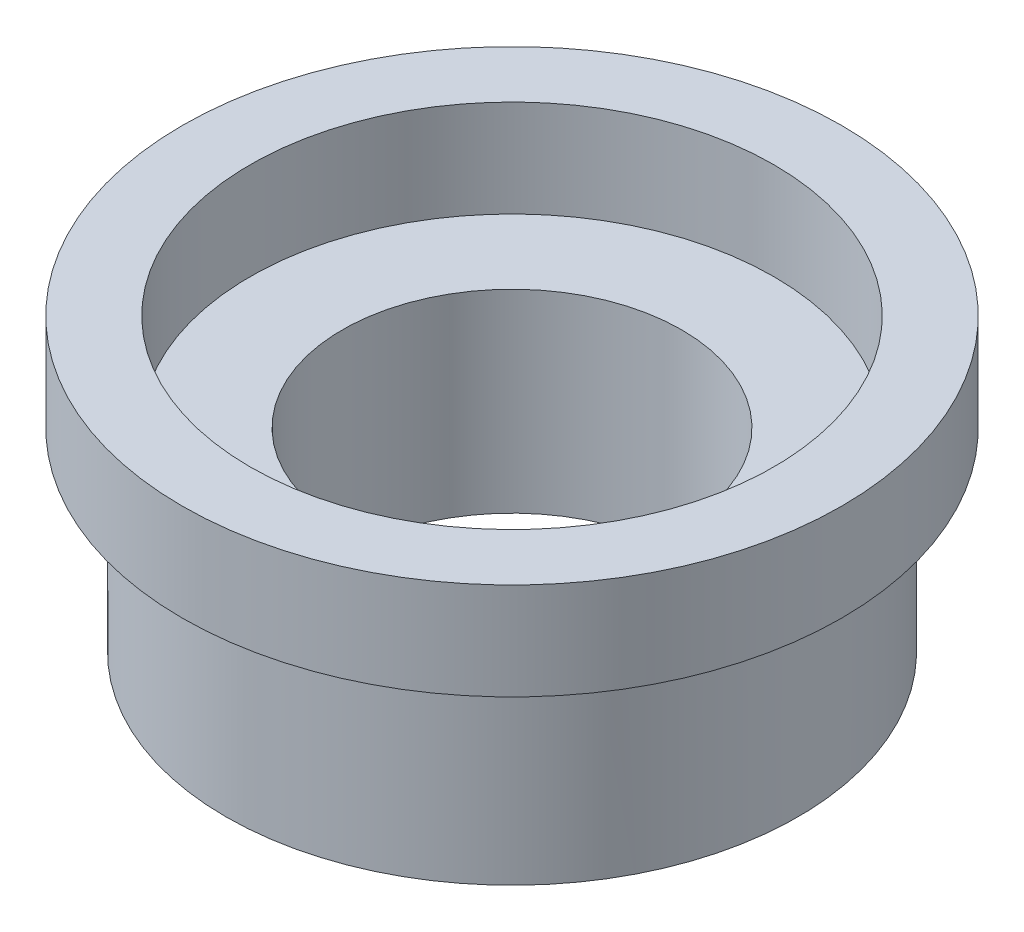
ISO-10303-21;
HEADER;
FILE_DESCRIPTION(('STEP AP214'),'2;1');
FILE_NAME('part.step','',(''),(''),'','','');
FILE_SCHEMA(('AUTOMOTIVE_DESIGN { 1 0 10303 214 1 1 1 1 }'));
ENDSEC;
DATA;
#1=APPLICATION_CONTEXT('core data for automotive mechanical design processes');
#2=APPLICATION_PROTOCOL_DEFINITION('international standard','automotive_design',2000,#1);
#3=PRODUCT_CONTEXT('',#1,'mechanical');
#4=PRODUCT('Part','Part','',(#3));
#5=PRODUCT_RELATED_PRODUCT_CATEGORY('part','',(#4));
#6=PRODUCT_DEFINITION_FORMATION('','',#4);
#7=PRODUCT_DEFINITION_CONTEXT('part definition',#1,'design');
#8=PRODUCT_DEFINITION('design','',#6,#7);
#9=PRODUCT_DEFINITION_SHAPE('','',#8);
#10=(LENGTH_UNIT() NAMED_UNIT(*) SI_UNIT(.MILLI.,.METRE.));
#11=(NAMED_UNIT(*) PLANE_ANGLE_UNIT() SI_UNIT($,.RADIAN.));
#12=(NAMED_UNIT(*) SI_UNIT($,.STERADIAN.) SOLID_ANGLE_UNIT());
#13=UNCERTAINTY_MEASURE_WITH_UNIT(LENGTH_MEASURE(1.E-05),#10,'distance_accuracy_value','');
#14=(GEOMETRIC_REPRESENTATION_CONTEXT(3) GLOBAL_UNCERTAINTY_ASSIGNED_CONTEXT((#13)) GLOBAL_UNIT_ASSIGNED_CONTEXT((#10,
#11,#12)) REPRESENTATION_CONTEXT('',''));
#15=CARTESIAN_POINT('',(0.,0.,0.));
#16=DIRECTION('',(0.,0.,1.));
#17=DIRECTION('',(1.,0.,0.));
#18=AXIS2_PLACEMENT_3D('',#15,#16,#17);
#19=CARTESIAN_POINT('',(0.,12.7,0.));
#20=DIRECTION('',(0.,1.,0.));
#21=DIRECTION('',(0.,0.,1.));
#22=AXIS2_PLACEMENT_3D('',#19,#20,#21);
#23=PLANE('',#22);
#24=CARTESIAN_POINT('',(0.,12.7,0.));
#25=DIRECTION('',(0.,1.,0.));
#26=DIRECTION('',(0.,0.,1.));
#27=AXIS2_PLACEMENT_3D('',#24,#25,#26);
#28=CIRCLE('',#27,43.18);
#29=CARTESIAN_POINT('',(0.,12.7,43.18));
#30=VERTEX_POINT('',#29);
#31=EDGE_CURVE('E42',#30,#30,#28,.T.);
#32=ORIENTED_EDGE('',*,*,#31,.T.);
#33=EDGE_LOOP('',(#32));
#34=FACE_BOUND('',#33,.T.);
#35=CARTESIAN_POINT('',(0.,12.7,0.));
#36=DIRECTION('',(0.,1.,0.));
#37=DIRECTION('',(0.,0.,1.));
#38=AXIS2_PLACEMENT_3D('',#35,#36,#37);
#39=CIRCLE('',#38,34.29);
#40=CARTESIAN_POINT('',(0.,12.7,34.29));
#41=VERTEX_POINT('',#40);
#42=EDGE_CURVE('E54',#41,#41,#39,.T.);
#43=ORIENTED_EDGE('',*,*,#42,.F.);
#44=EDGE_LOOP('',(#43));
#45=FACE_BOUND('',#44,.T.);
#46=ADVANCED_FACE('F35',(#34,#45),#23,.T.);
#47=CARTESIAN_POINT('',(0.,0.,0.));
#48=DIRECTION('',(0.,1.,0.));
#49=DIRECTION('',(0.,0.,1.));
#50=AXIS2_PLACEMENT_3D('',#47,#48,#49);
#51=PLANE('',#50);
#52=CARTESIAN_POINT('',(0.,0.,0.));
#53=DIRECTION('',(0.,1.,0.));
#54=DIRECTION('',(0.,0.,1.));
#55=AXIS2_PLACEMENT_3D('',#52,#53,#54);
#56=CIRCLE('',#55,37.465);
#57=CARTESIAN_POINT('',(0.,0.,37.465));
#58=VERTEX_POINT('',#57);
#59=EDGE_CURVE('E10',#58,#58,#56,.F.);
#60=ORIENTED_EDGE('',*,*,#59,.F.);
#61=EDGE_LOOP('',(#60));
#62=FACE_BOUND('',#61,.T.);
#63=CARTESIAN_POINT('',(0.,0.,0.));
#64=DIRECTION('',(0.,1.,0.));
#65=DIRECTION('',(0.,0.,1.));
#66=AXIS2_PLACEMENT_3D('',#63,#64,#65);
#67=CIRCLE('',#66,43.18);
#68=CARTESIAN_POINT('',(0.,0.,43.18));
#69=VERTEX_POINT('',#68);
#70=EDGE_CURVE('E47',#69,#69,#67,.T.);
#71=ORIENTED_EDGE('',*,*,#70,.F.);
#72=EDGE_LOOP('',(#71));
#73=FACE_BOUND('',#72,.T.);
#74=ADVANCED_FACE('F93',(#62,#73),#51,.F.);
#75=CARTESIAN_POINT('',(0.,12.7,0.));
#76=DIRECTION('',(0.,-1.,0.));
#77=DIRECTION('',(0.,0.,-1.));
#78=AXIS2_PLACEMENT_3D('',#75,#76,#77);
#79=CYLINDRICAL_SURFACE('',#78,43.18);
#80=ORIENTED_EDGE('',*,*,#31,.F.);
#81=EDGE_LOOP('',(#80));
#82=FACE_BOUND('',#81,.T.);
#83=ORIENTED_EDGE('',*,*,#70,.T.);
#84=EDGE_LOOP('',(#83));
#85=FACE_BOUND('',#84,.T.);
#86=ADVANCED_FACE('F37',(#82,#85),#79,.T.);
#87=CARTESIAN_POINT('',(0.,12.7,0.));
#88=DIRECTION('',(0.,-1.,0.));
#89=DIRECTION('',(0.,0.,-1.));
#90=AXIS2_PLACEMENT_3D('',#87,#88,#89);
#91=CYLINDRICAL_SURFACE('',#90,34.29);
#92=ORIENTED_EDGE('',*,*,#42,.T.);
#93=EDGE_LOOP('',(#92));
#94=FACE_BOUND('',#93,.T.);
#95=CARTESIAN_POINT('',(0.,0.,0.));
#96=DIRECTION('',(0.,1.,0.));
#97=DIRECTION('',(0.,0.,1.));
#98=AXIS2_PLACEMENT_3D('',#95,#96,#97);
#99=CIRCLE('',#98,34.29);
#100=CARTESIAN_POINT('',(0.,0.,34.29));
#101=VERTEX_POINT('',#100);
#102=EDGE_CURVE('E56',#101,#101,#99,.T.);
#103=ORIENTED_EDGE('',*,*,#102,.F.);
#104=EDGE_LOOP('',(#103));
#105=FACE_BOUND('',#104,.T.);
#106=ADVANCED_FACE('F88',(#94,#105),#91,.F.);
#107=CARTESIAN_POINT('',(0.,0.,0.));
#108=DIRECTION('',(0.,-1.,0.));
#109=DIRECTION('',(0.,0.,-1.));
#110=AXIS2_PLACEMENT_3D('',#107,#108,#109);
#111=PLANE('',#110);
#112=CARTESIAN_POINT('',(0.,0.,0.));
#113=DIRECTION('',(0.,-1.,0.));
#114=DIRECTION('',(0.,0.,-1.));
#115=AXIS2_PLACEMENT_3D('',#112,#113,#114);
#116=CIRCLE('',#115,22.225);
#117=CARTESIAN_POINT('',(0.,0.,-22.225));
#118=VERTEX_POINT('',#117);
#119=EDGE_CURVE('E66',#118,#118,#116,.T.);
#120=ORIENTED_EDGE('',*,*,#119,.T.);
#121=EDGE_LOOP('',(#120));
#122=FACE_BOUND('',#121,.T.);
#123=ORIENTED_EDGE('',*,*,#102,.T.);
#124=EDGE_LOOP('',(#123));
#125=FACE_BOUND('',#124,.T.);
#126=ADVANCED_FACE('F79',(#122,#125),#111,.F.);
#127=CARTESIAN_POINT('',(0.,-25.4,0.));
#128=DIRECTION('',(0.,-1.,0.));
#129=DIRECTION('',(0.,0.,-1.));
#130=AXIS2_PLACEMENT_3D('',#127,#128,#129);
#131=PLANE('',#130);
#132=CARTESIAN_POINT('',(0.,-25.4,0.));
#133=DIRECTION('',(0.,-1.,0.));
#134=DIRECTION('',(0.,0.,-1.));
#135=AXIS2_PLACEMENT_3D('',#132,#133,#134);
#136=CIRCLE('',#135,37.465);
#137=CARTESIAN_POINT('',(0.,-25.4,-37.465));
#138=VERTEX_POINT('',#137);
#139=EDGE_CURVE('E59',#138,#138,#136,.T.);
#140=ORIENTED_EDGE('',*,*,#139,.T.);
#141=EDGE_LOOP('',(#140));
#142=FACE_BOUND('',#141,.T.);
#143=CARTESIAN_POINT('',(0.,-25.4,0.));
#144=DIRECTION('',(0.,-1.,0.));
#145=DIRECTION('',(0.,0.,-1.));
#146=AXIS2_PLACEMENT_3D('',#143,#144,#145);
#147=CIRCLE('',#146,22.225);
#148=CARTESIAN_POINT('',(0.,-25.4,-22.225));
#149=VERTEX_POINT('',#148);
#150=EDGE_CURVE('E65',#149,#149,#147,.T.);
#151=ORIENTED_EDGE('',*,*,#150,.F.);
#152=EDGE_LOOP('',(#151));
#153=FACE_BOUND('',#152,.T.);
#154=ADVANCED_FACE('F76',(#142,#153),#131,.T.);
#155=CARTESIAN_POINT('',(0.,-25.4,0.));
#156=DIRECTION('',(0.,1.,0.));
#157=DIRECTION('',(0.,0.,1.));
#158=AXIS2_PLACEMENT_3D('',#155,#156,#157);
#159=CYLINDRICAL_SURFACE('',#158,37.465);
#160=ORIENTED_EDGE('',*,*,#139,.F.);
#161=EDGE_LOOP('',(#160));
#162=FACE_BOUND('',#161,.T.);
#163=ORIENTED_EDGE('',*,*,#59,.T.);
#164=EDGE_LOOP('',(#163));
#165=FACE_BOUND('',#164,.T.);
#166=ADVANCED_FACE('F78',(#162,#165),#159,.T.);
#167=CARTESIAN_POINT('',(0.,-25.4,0.));
#168=DIRECTION('',(0.,1.,0.));
#169=DIRECTION('',(0.,0.,1.));
#170=AXIS2_PLACEMENT_3D('',#167,#168,#169);
#171=CYLINDRICAL_SURFACE('',#170,22.225);
#172=ORIENTED_EDGE('',*,*,#150,.T.);
#173=EDGE_LOOP('',(#172));
#174=FACE_BOUND('',#173,.T.);
#175=ORIENTED_EDGE('',*,*,#119,.F.);
#176=EDGE_LOOP('',(#175));
#177=FACE_BOUND('',#176,.T.);
#178=ADVANCED_FACE('F73',(#174,#177),#171,.F.);
#179=CLOSED_SHELL('',(#46,#74,#86,#106,#126,#154,#166,#178));
#180=MANIFOLD_SOLID_BREP('B2',#179);
#181=ADVANCED_BREP_SHAPE_REPRESENTATION('',(#18,#180),#14);
#182=SHAPE_DEFINITION_REPRESENTATION(#9,#181);
ENDSEC;
END-ISO-10303-21;
